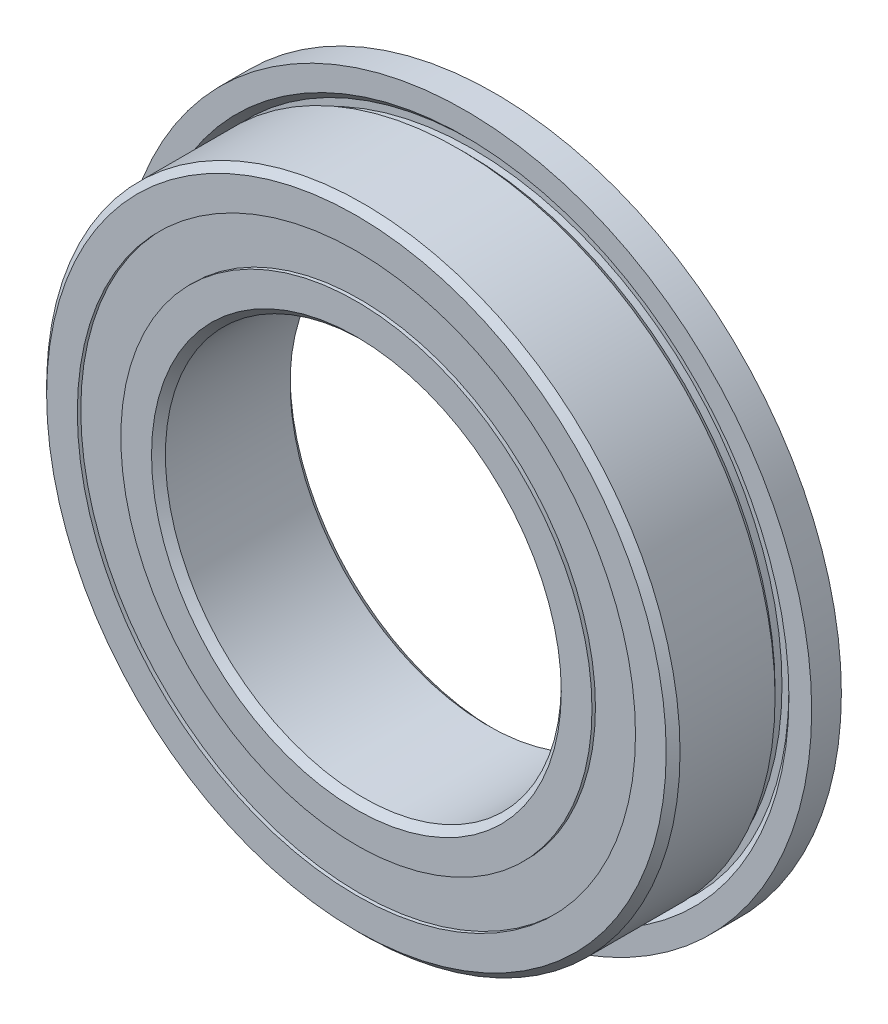
ISO-10303-21;
HEADER;
FILE_DESCRIPTION(('STEP AP214'),'2;1');
FILE_NAME('part.step','',(''),(''),'','','');
FILE_SCHEMA(('AUTOMOTIVE_DESIGN { 1 0 10303 214 1 1 1 1 }'));
ENDSEC;
DATA;
#1=APPLICATION_CONTEXT('core data for automotive mechanical design processes');
#2=APPLICATION_PROTOCOL_DEFINITION('international standard','automotive_design',2000,#1);
#3=PRODUCT_CONTEXT('',#1,'mechanical');
#4=PRODUCT('Part','Part','',(#3));
#5=PRODUCT_RELATED_PRODUCT_CATEGORY('part','',(#4));
#6=PRODUCT_DEFINITION_FORMATION('','',#4);
#7=PRODUCT_DEFINITION_CONTEXT('part definition',#1,'design');
#8=PRODUCT_DEFINITION('design','',#6,#7);
#9=PRODUCT_DEFINITION_SHAPE('','',#8);
#10=(LENGTH_UNIT() NAMED_UNIT(*) SI_UNIT(.MILLI.,.METRE.));
#11=(NAMED_UNIT(*) PLANE_ANGLE_UNIT() SI_UNIT($,.RADIAN.));
#12=(NAMED_UNIT(*) SI_UNIT($,.STERADIAN.) SOLID_ANGLE_UNIT());
#13=UNCERTAINTY_MEASURE_WITH_UNIT(LENGTH_MEASURE(1.E-05),#10,'distance_accuracy_value','');
#14=(GEOMETRIC_REPRESENTATION_CONTEXT(3) GLOBAL_UNCERTAINTY_ASSIGNED_CONTEXT((#13)) GLOBAL_UNIT_ASSIGNED_CONTEXT((#10,
#11,#12)) REPRESENTATION_CONTEXT('',''));
#15=CARTESIAN_POINT('',(0.,0.,0.));
#16=DIRECTION('',(0.,0.,1.));
#17=DIRECTION('',(1.,0.,0.));
#18=AXIS2_PLACEMENT_3D('',#15,#16,#17);
#19=CARTESIAN_POINT('',(0.,14.0989010989011,-3.325));
#20=DIRECTION('',(0.,0.,1.));
#21=DIRECTION('',(1.,0.,0.));
#22=AXIS2_PLACEMENT_3D('',#19,#20,#21);
#23=PLANE('',#22);
#24=CARTESIAN_POINT('',(0.,0.,-3.325));
#25=DIRECTION('',(0.,0.,1.));
#26=DIRECTION('',(1.,0.,0.));
#27=AXIS2_PLACEMENT_3D('',#24,#25,#26);
#28=CIRCLE('',#27,14.0989010989011);
#29=CARTESIAN_POINT('',(14.0989010989011,0.,-3.325));
#30=VERTEX_POINT('',#29);
#31=EDGE_CURVE('E62',#30,#30,#28,.T.);
#32=ORIENTED_EDGE('',*,*,#31,.F.);
#33=EDGE_LOOP('',(#32));
#34=FACE_BOUND('',#33,.T.);
#35=CARTESIAN_POINT('',(0.,0.,-3.325));
#36=DIRECTION('',(0.,0.,1.));
#37=DIRECTION('',(1.,0.,0.));
#38=AXIS2_PLACEMENT_3D('',#35,#36,#37);
#39=CIRCLE('',#38,11.9010989010989);
#40=CARTESIAN_POINT('',(11.9010989010989,0.,-3.325));
#41=VERTEX_POINT('',#40);
#42=EDGE_CURVE('E11',#41,#41,#39,.T.);
#43=ORIENTED_EDGE('',*,*,#42,.T.);
#44=EDGE_LOOP('',(#43));
#45=FACE_BOUND('',#44,.T.);
#46=ADVANCED_FACE('F48',(#34,#45),#23,.F.);
#47=CARTESIAN_POINT('',(0.,0.,3.5));
#48=DIRECTION('',(0.,0.,1.));
#49=DIRECTION('',(1.,0.,0.));
#50=AXIS2_PLACEMENT_3D('',#47,#48,#49);
#51=CYLINDRICAL_SURFACE('',#50,11.9010989010989);
#52=ORIENTED_EDGE('',*,*,#42,.F.);
#53=EDGE_LOOP('',(#52));
#54=FACE_BOUND('',#53,.T.);
#55=CARTESIAN_POINT('',(0.,0.,-1.90455682813241));
#56=DIRECTION('',(0.,0.,1.));
#57=DIRECTION('',(1.,0.,0.));
#58=AXIS2_PLACEMENT_3D('',#55,#56,#57);
#59=CIRCLE('',#58,11.9010989010989);
#60=CARTESIAN_POINT('',(11.9010989010989,0.,-1.90455682813241));
#61=VERTEX_POINT('',#60);
#62=EDGE_CURVE('E54',#61,#61,#59,.T.);
#63=ORIENTED_EDGE('',*,*,#62,.T.);
#64=EDGE_LOOP('',(#63));
#65=FACE_BOUND('',#64,.T.);
#66=ADVANCED_FACE('F71',(#54,#65),#51,.F.);
#67=CARTESIAN_POINT('',(0.,14.0989010989011,-1.90455682813241));
#68=DIRECTION('',(0.,0.,-1.));
#69=DIRECTION('',(-1.,0.,0.));
#70=AXIS2_PLACEMENT_3D('',#67,#68,#69);
#71=PLANE('',#70);
#72=ORIENTED_EDGE('',*,*,#62,.F.);
#73=EDGE_LOOP('',(#72));
#74=FACE_BOUND('',#73,.T.);
#75=CARTESIAN_POINT('',(0.,0.,-1.90455682813241));
#76=DIRECTION('',(0.,0.,1.));
#77=DIRECTION('',(1.,0.,0.));
#78=AXIS2_PLACEMENT_3D('',#75,#76,#77);
#79=CIRCLE('',#78,14.0989010989011);
#80=CARTESIAN_POINT('',(14.0989010989011,0.,-1.90455682813241));
#81=VERTEX_POINT('',#80);
#82=EDGE_CURVE('E58',#81,#81,#79,.T.);
#83=ORIENTED_EDGE('',*,*,#82,.T.);
#84=EDGE_LOOP('',(#83));
#85=FACE_BOUND('',#84,.T.);
#86=ADVANCED_FACE('F75',(#74,#85),#71,.F.);
#87=CARTESIAN_POINT('',(0.,0.,3.5));
#88=DIRECTION('',(0.,0.,1.));
#89=DIRECTION('',(1.,0.,0.));
#90=AXIS2_PLACEMENT_3D('',#87,#88,#89);
#91=CYLINDRICAL_SURFACE('',#90,14.0989010989011);
#92=ORIENTED_EDGE('',*,*,#82,.F.);
#93=EDGE_LOOP('',(#92));
#94=FACE_BOUND('',#93,.T.);
#95=ORIENTED_EDGE('',*,*,#31,.T.);
#96=EDGE_LOOP('',(#95));
#97=FACE_BOUND('',#96,.T.);
#98=ADVANCED_FACE('F68',(#94,#97),#91,.T.);
#99=CLOSED_SHELL('',(#46,#66,#86,#98));
#100=MANIFOLD_SOLID_BREP('B2',#99);
#101=CARTESIAN_POINT('',(0.,14.0989010989011,3.325));
#102=DIRECTION('',(0.,0.,-1.));
#103=DIRECTION('',(-1.,0.,0.));
#104=AXIS2_PLACEMENT_3D('',#101,#102,#103);
#105=PLANE('',#104);
#106=CARTESIAN_POINT('',(0.,0.,3.325));
#107=DIRECTION('',(0.,0.,1.));
#108=DIRECTION('',(1.,0.,0.));
#109=AXIS2_PLACEMENT_3D('',#106,#107,#108);
#110=CIRCLE('',#109,11.9010989010989);
#111=CARTESIAN_POINT('',(11.9010989010989,0.,3.325));
#112=VERTEX_POINT('',#111);
#113=EDGE_CURVE('E47',#112,#112,#110,.T.);
#114=ORIENTED_EDGE('',*,*,#113,.F.);
#115=EDGE_LOOP('',(#114));
#116=FACE_BOUND('',#115,.T.);
#117=CARTESIAN_POINT('',(0.,0.,3.325));
#118=DIRECTION('',(0.,0.,1.));
#119=DIRECTION('',(1.,0.,0.));
#120=AXIS2_PLACEMENT_3D('',#117,#118,#119);
#121=CIRCLE('',#120,14.0989010989011);
#122=CARTESIAN_POINT('',(14.0989010989011,0.,3.325));
#123=VERTEX_POINT('',#122);
#124=EDGE_CURVE('E132',#123,#123,#121,.T.);
#125=ORIENTED_EDGE('',*,*,#124,.T.);
#126=EDGE_LOOP('',(#125));
#127=FACE_BOUND('',#126,.T.);
#128=ADVANCED_FACE('F118',(#116,#127),#105,.F.);
#129=CARTESIAN_POINT('',(0.,0.,3.5));
#130=DIRECTION('',(0.,0.,1.));
#131=DIRECTION('',(1.,0.,0.));
#132=AXIS2_PLACEMENT_3D('',#129,#130,#131);
#133=CYLINDRICAL_SURFACE('',#132,11.9010989010989);
#134=CARTESIAN_POINT('',(0.,0.,1.90455682813241));
#135=DIRECTION('',(0.,0.,1.));
#136=DIRECTION('',(1.,0.,0.));
#137=AXIS2_PLACEMENT_3D('',#134,#135,#136);
#138=CIRCLE('',#137,11.9010989010989);
#139=CARTESIAN_POINT('',(11.9010989010989,0.,1.90455682813241));
#140=VERTEX_POINT('',#139);
#141=EDGE_CURVE('E124',#140,#140,#138,.T.);
#142=ORIENTED_EDGE('',*,*,#141,.F.);
#143=EDGE_LOOP('',(#142));
#144=FACE_BOUND('',#143,.T.);
#145=ORIENTED_EDGE('',*,*,#113,.T.);
#146=EDGE_LOOP('',(#145));
#147=FACE_BOUND('',#146,.T.);
#148=ADVANCED_FACE('F147',(#144,#147),#133,.F.);
#149=CARTESIAN_POINT('',(0.,14.0989010989011,1.90455682813241));
#150=DIRECTION('',(0.,0.,1.));
#151=DIRECTION('',(1.,0.,0.));
#152=AXIS2_PLACEMENT_3D('',#149,#150,#151);
#153=PLANE('',#152);
#154=CARTESIAN_POINT('',(0.,0.,1.90455682813241));
#155=DIRECTION('',(0.,0.,1.));
#156=DIRECTION('',(1.,0.,0.));
#157=AXIS2_PLACEMENT_3D('',#154,#155,#156);
#158=CIRCLE('',#157,14.0989010989011);
#159=CARTESIAN_POINT('',(14.0989010989011,0.,1.90455682813241));
#160=VERTEX_POINT('',#159);
#161=EDGE_CURVE('E128',#160,#160,#158,.T.);
#162=ORIENTED_EDGE('',*,*,#161,.F.);
#163=EDGE_LOOP('',(#162));
#164=FACE_BOUND('',#163,.T.);
#165=ORIENTED_EDGE('',*,*,#141,.T.);
#166=EDGE_LOOP('',(#165));
#167=FACE_BOUND('',#166,.T.);
#168=ADVANCED_FACE('F142',(#164,#167),#153,.F.);
#169=CARTESIAN_POINT('',(0.,0.,3.5));
#170=DIRECTION('',(0.,0.,1.));
#171=DIRECTION('',(1.,0.,0.));
#172=AXIS2_PLACEMENT_3D('',#169,#170,#171);
#173=CYLINDRICAL_SURFACE('',#172,14.0989010989011);
#174=ORIENTED_EDGE('',*,*,#124,.F.);
#175=EDGE_LOOP('',(#174));
#176=FACE_BOUND('',#175,.T.);
#177=ORIENTED_EDGE('',*,*,#161,.T.);
#178=EDGE_LOOP('',(#177));
#179=FACE_BOUND('',#178,.T.);
#180=ADVANCED_FACE('F139',(#176,#179),#173,.T.);
#181=CLOSED_SHELL('',(#128,#148,#168,#180));
#182=MANIFOLD_SOLID_BREP('B6',#181);
#183=CARTESIAN_POINT('',(-6.04140123656885,11.5109283334918,0.));
#184=DIRECTION('',(0.,0.,1.));
#185=DIRECTION('',(-0.464723172043757,0.885456025653216,0.));
#186=AXIS2_PLACEMENT_3D('',#183,#184,#185);
#187=SPHERICAL_SURFACE('',#186,1.90455682813241);
#188=CARTESIAN_POINT('',(-6.04140123656885,11.5109283334918,1.90455682813241));
#189=VERTEX_POINT('',#188);
#190=VERTEX_LOOP('',#189);
#191=FACE_BOUND('',#190,.T.);
#192=ADVANCED_FACE('F188',(#191),#187,.T.);
#193=CLOSED_SHELL('',(#192));
#194=MANIFOLD_SOLID_BREP('B42',#193);
#195=CARTESIAN_POINT('',(-10.6987902566174,7.38484170750516,0.));
#196=DIRECTION('',(0.,0.,1.));
#197=DIRECTION('',(-0.822983865893649,0.568064746731166,0.));
#198=AXIS2_PLACEMENT_3D('',#195,#196,#197);
#199=SPHERICAL_SURFACE('',#198,1.90455682813241);
#200=CARTESIAN_POINT('',(-10.6987902566174,7.38484170750516,1.90455682813241));
#201=VERTEX_POINT('',#200);
#202=VERTEX_LOOP('',#201);
#203=FACE_BOUND('',#202,.T.);
#204=ADVANCED_FACE('F211',(#203),#199,.T.);
#205=CLOSED_SHELL('',(#204));
#206=MANIFOLD_SOLID_BREP('B114',#205);
#207=CARTESIAN_POINT('',(-12.9052153632747,1.56697684331934,0.));
#208=DIRECTION('',(0.,0.,1.));
#209=DIRECTION('',(-0.992708874098053,0.120536680255334,0.));
#210=AXIS2_PLACEMENT_3D('',#207,#208,#209);
#211=SPHERICAL_SURFACE('',#210,1.90455682813241);
#212=CARTESIAN_POINT('',(-12.9052153632747,1.56697684331934,1.90455682813241));
#213=VERTEX_POINT('',#212);
#214=VERTEX_LOOP('',#213);
#215=FACE_BOUND('',#214,.T.);
#216=ADVANCED_FACE('F234',(#215),#211,.T.);
#217=CLOSED_SHELL('',(#216));
#218=MANIFOLD_SOLID_BREP('B184',#217);
#219=CARTESIAN_POINT('',(-12.1552111549104,-4.60986353155285,0.));
#220=DIRECTION('',(0.,0.,1.));
#221=DIRECTION('',(-0.935016242685418,-0.354604887042527,0.));
#222=AXIS2_PLACEMENT_3D('',#219,#220,#221);
#223=SPHERICAL_SURFACE('',#222,1.90455682813241);
#224=CARTESIAN_POINT('',(-12.1552111549104,-4.60986353155285,1.90455682813241));
#225=VERTEX_POINT('',#224);
#226=VERTEX_LOOP('',#225);
#227=FACE_BOUND('',#226,.T.);
#228=ADVANCED_FACE('F257',(#227),#223,.T.);
#229=CLOSED_SHELL('',(#228));
#230=MANIFOLD_SOLID_BREP('B207',#229);
#231=CARTESIAN_POINT('',(-8.62059455713042,-9.73063972622424,0.));
#232=DIRECTION('',(0.,0.,1.));
#233=DIRECTION('',(-0.663122658240802,-0.748510748171095,0.));
#234=AXIS2_PLACEMENT_3D('',#231,#232,#233);
#235=SPHERICAL_SURFACE('',#234,1.90455682813241);
#236=CARTESIAN_POINT('',(-8.62059455713042,-9.73063972622424,1.90455682813241));
#237=VERTEX_POINT('',#236);
#238=VERTEX_LOOP('',#237);
#239=FACE_BOUND('',#238,.T.);
#240=ADVANCED_FACE('F280',(#239),#235,.T.);
#241=CLOSED_SHELL('',(#240));
#242=MANIFOLD_SOLID_BREP('B230',#241);
#243=CARTESIAN_POINT('',(-3.11110363573835,-12.6222436265387,0.));
#244=DIRECTION('',(0.,0.,1.));
#245=DIRECTION('',(-0.239315664287565,-0.97094181742605,0.));
#246=AXIS2_PLACEMENT_3D('',#243,#244,#245);
#247=SPHERICAL_SURFACE('',#246,1.90455682813241);
#248=CARTESIAN_POINT('',(-3.11110363573835,-12.6222436265387,1.90455682813241));
#249=VERTEX_POINT('',#248);
#250=VERTEX_LOOP('',#249);
#251=FACE_BOUND('',#250,.T.);
#252=ADVANCED_FACE('F303',(#251),#247,.T.);
#253=CLOSED_SHELL('',(#252));
#254=MANIFOLD_SOLID_BREP('B253',#253);
#255=CARTESIAN_POINT('',(3.11110363573817,-12.6222436265387,0.));
#256=DIRECTION('',(0.,0.,1.));
#257=DIRECTION('',(0.239315664287552,-0.970941817426054,0.));
#258=AXIS2_PLACEMENT_3D('',#255,#256,#257);
#259=SPHERICAL_SURFACE('',#258,1.90455682813241);
#260=CARTESIAN_POINT('',(3.11110363573817,-12.6222436265387,1.90455682813241));
#261=VERTEX_POINT('',#260);
#262=VERTEX_LOOP('',#261);
#263=FACE_BOUND('',#262,.T.);
#264=ADVANCED_FACE('F326',(#263),#259,.T.);
#265=CLOSED_SHELL('',(#264));
#266=MANIFOLD_SOLID_BREP('B276',#265);
#267=CARTESIAN_POINT('',(8.62059455713029,-9.73063972622436,0.));
#268=DIRECTION('',(0.,0.,1.));
#269=DIRECTION('',(0.663122658240791,-0.748510748171105,0.));
#270=AXIS2_PLACEMENT_3D('',#267,#268,#269);
#271=SPHERICAL_SURFACE('',#270,1.90455682813241);
#272=CARTESIAN_POINT('',(8.62059455713029,-9.73063972622436,1.90455682813241));
#273=VERTEX_POINT('',#272);
#274=VERTEX_LOOP('',#273);
#275=FACE_BOUND('',#274,.T.);
#276=ADVANCED_FACE('F349',(#275),#271,.T.);
#277=CLOSED_SHELL('',(#276));
#278=MANIFOLD_SOLID_BREP('B299',#277);
#279=CARTESIAN_POINT('',(12.1552111549104,-4.60986353155302,0.));
#280=DIRECTION('',(0.,0.,1.));
#281=DIRECTION('',(0.935016242685413,-0.35460488704254,0.));
#282=AXIS2_PLACEMENT_3D('',#279,#280,#281);
#283=SPHERICAL_SURFACE('',#282,1.90455682813241);
#284=CARTESIAN_POINT('',(12.1552111549104,-4.60986353155302,1.90455682813241));
#285=VERTEX_POINT('',#284);
#286=VERTEX_LOOP('',#285);
#287=FACE_BOUND('',#286,.T.);
#288=ADVANCED_FACE('F372',(#287),#283,.T.);
#289=CLOSED_SHELL('',(#288));
#290=MANIFOLD_SOLID_BREP('B322',#289);
#291=CARTESIAN_POINT('',(12.9052153632747,1.56697684331916,0.));
#292=DIRECTION('',(0.,0.,1.));
#293=DIRECTION('',(0.992708874098054,0.12053668025532,0.));
#294=AXIS2_PLACEMENT_3D('',#291,#292,#293);
#295=SPHERICAL_SURFACE('',#294,1.90455682813241);
#296=CARTESIAN_POINT('',(12.9052153632747,1.56697684331916,1.90455682813241));
#297=VERTEX_POINT('',#296);
#298=VERTEX_LOOP('',#297);
#299=FACE_BOUND('',#298,.T.);
#300=ADVANCED_FACE('F395',(#299),#295,.T.);
#301=CLOSED_SHELL('',(#300));
#302=MANIFOLD_SOLID_BREP('B345',#301);
#303=CARTESIAN_POINT('',(10.6987902566176,7.384841707505,0.));
#304=DIRECTION('',(0.,0.,1.));
#305=DIRECTION('',(0.822983865893658,0.568064746731154,0.));
#306=AXIS2_PLACEMENT_3D('',#303,#304,#305);
#307=SPHERICAL_SURFACE('',#306,1.90455682813241);
#308=CARTESIAN_POINT('',(10.6987902566176,7.384841707505,1.90455682813241));
#309=VERTEX_POINT('',#308);
#310=VERTEX_LOOP('',#309);
#311=FACE_BOUND('',#310,.T.);
#312=ADVANCED_FACE('F418',(#311),#307,.T.);
#313=CLOSED_SHELL('',(#312));
#314=MANIFOLD_SOLID_BREP('B368',#313);
#315=CARTESIAN_POINT('',(6.04140123656901,11.5109283334917,0.));
#316=DIRECTION('',(0.,0.,1.));
#317=DIRECTION('',(0.46472317204377,0.885456025653209,0.));
#318=AXIS2_PLACEMENT_3D('',#315,#316,#317);
#319=SPHERICAL_SURFACE('',#318,1.90455682813241);
#320=CARTESIAN_POINT('',(6.04140123656901,11.5109283334917,1.90455682813241));
#321=VERTEX_POINT('',#320);
#322=VERTEX_LOOP('',#321);
#323=FACE_BOUND('',#322,.T.);
#324=ADVANCED_FACE('F441',(#323),#319,.T.);
#325=CLOSED_SHELL('',(#324));
#326=MANIFOLD_SOLID_BREP('B391',#325);
#327=CARTESIAN_POINT('',(0.,13.,0.));
#328=DIRECTION('',(0.,0.,1.));
#329=DIRECTION('',(0.,1.,0.));
#330=AXIS2_PLACEMENT_3D('',#327,#328,#329);
#331=SPHERICAL_SURFACE('',#330,1.90455682813241);
#332=CARTESIAN_POINT('',(0.,13.,1.90455682813241));
#333=VERTEX_POINT('',#332);
#334=VERTEX_LOOP('',#333);
#335=FACE_BOUND('',#334,.T.);
#336=ADVANCED_FACE('F466',(#335),#331,.T.);
#337=CLOSED_SHELL('',(#336));
#338=MANIFOLD_SOLID_BREP('B414',#337);
#339=CARTESIAN_POINT('',(0.,13.5494505494506,0.183150183150183));
#340=DIRECTION('',(0.,0.,-1.));
#341=DIRECTION('',(-1.,0.,0.));
#342=AXIS2_PLACEMENT_3D('',#339,#340,#341);
#343=PLANE('',#342);
#344=CARTESIAN_POINT('',(0.,0.,0.183150183150183));
#345=DIRECTION('',(0.,0.,1.));
#346=DIRECTION('',(1.,0.,0.));
#347=AXIS2_PLACEMENT_3D('',#344,#345,#346);
#348=CIRCLE('',#347,12.4505494505495);
#349=CARTESIAN_POINT('',(12.4505494505495,0.,0.183150183150183));
#350=VERTEX_POINT('',#349);
#351=EDGE_CURVE('E465',#350,#350,#348,.T.);
#352=ORIENTED_EDGE('',*,*,#351,.F.);
#353=EDGE_LOOP('',(#352));
#354=FACE_BOUND('',#353,.T.);
#355=CARTESIAN_POINT('',(0.,0.,0.183150183150183));
#356=DIRECTION('',(0.,0.,1.));
#357=DIRECTION('',(1.,0.,0.));
#358=AXIS2_PLACEMENT_3D('',#355,#356,#357);
#359=CIRCLE('',#358,13.5494505494506);
#360=CARTESIAN_POINT('',(13.5494505494506,0.,0.183150183150183));
#361=VERTEX_POINT('',#360);
#362=EDGE_CURVE('E503',#361,#361,#359,.T.);
#363=ORIENTED_EDGE('',*,*,#362,.T.);
#364=EDGE_LOOP('',(#363));
#365=FACE_BOUND('',#364,.T.);
#366=ADVANCED_FACE('F489',(#354,#365),#343,.F.);
#367=CARTESIAN_POINT('',(0.,0.,3.5));
#368=DIRECTION('',(0.,0.,1.));
#369=DIRECTION('',(1.,0.,0.));
#370=AXIS2_PLACEMENT_3D('',#367,#368,#369);
#371=CYLINDRICAL_SURFACE('',#370,12.4505494505495);
#372=CARTESIAN_POINT('',(0.,0.,-0.183150183150183));
#373=DIRECTION('',(0.,0.,1.));
#374=DIRECTION('',(1.,0.,0.));
#375=AXIS2_PLACEMENT_3D('',#372,#373,#374);
#376=CIRCLE('',#375,12.4505494505495);
#377=CARTESIAN_POINT('',(12.4505494505495,0.,-0.183150183150183));
#378=VERTEX_POINT('',#377);
#379=EDGE_CURVE('E495',#378,#378,#376,.T.);
#380=ORIENTED_EDGE('',*,*,#379,.F.);
#381=EDGE_LOOP('',(#380));
#382=FACE_BOUND('',#381,.T.);
#383=ORIENTED_EDGE('',*,*,#351,.T.);
#384=EDGE_LOOP('',(#383));
#385=FACE_BOUND('',#384,.T.);
#386=ADVANCED_FACE('F518',(#382,#385),#371,.F.);
#387=CARTESIAN_POINT('',(0.,13.5494505494506,-0.183150183150183));
#388=DIRECTION('',(0.,0.,1.));
#389=DIRECTION('',(1.,0.,0.));
#390=AXIS2_PLACEMENT_3D('',#387,#388,#389);
#391=PLANE('',#390);
#392=CARTESIAN_POINT('',(0.,0.,-0.183150183150183));
#393=DIRECTION('',(0.,0.,1.));
#394=DIRECTION('',(1.,0.,0.));
#395=AXIS2_PLACEMENT_3D('',#392,#393,#394);
#396=CIRCLE('',#395,13.5494505494506);
#397=CARTESIAN_POINT('',(13.5494505494506,0.,-0.183150183150183));
#398=VERTEX_POINT('',#397);
#399=EDGE_CURVE('E499',#398,#398,#396,.T.);
#400=ORIENTED_EDGE('',*,*,#399,.F.);
#401=EDGE_LOOP('',(#400));
#402=FACE_BOUND('',#401,.T.);
#403=ORIENTED_EDGE('',*,*,#379,.T.);
#404=EDGE_LOOP('',(#403));
#405=FACE_BOUND('',#404,.T.);
#406=ADVANCED_FACE('F513',(#402,#405),#391,.F.);
#407=CARTESIAN_POINT('',(0.,0.,3.5));
#408=DIRECTION('',(0.,0.,1.));
#409=DIRECTION('',(1.,0.,0.));
#410=AXIS2_PLACEMENT_3D('',#407,#408,#409);
#411=CYLINDRICAL_SURFACE('',#410,13.5494505494506);
#412=ORIENTED_EDGE('',*,*,#362,.F.);
#413=EDGE_LOOP('',(#412));
#414=FACE_BOUND('',#413,.T.);
#415=ORIENTED_EDGE('',*,*,#399,.T.);
#416=EDGE_LOOP('',(#415));
#417=FACE_BOUND('',#416,.T.);
#418=ADVANCED_FACE('F510',(#414,#417),#411,.T.);
#419=CLOSED_SHELL('',(#366,#386,#406,#418));
#420=MANIFOLD_SOLID_BREP('B437',#419);
#421=CARTESIAN_POINT('',(0.,11.9010989010989,3.5));
#422=DIRECTION('',(0.,0.,-1.));
#423=DIRECTION('',(-1.,0.,0.));
#424=AXIS2_PLACEMENT_3D('',#421,#422,#423);
#425=PLANE('',#424);
#426=CARTESIAN_POINT('',(0.,0.,3.5));
#427=DIRECTION('',(0.,0.,1.));
#428=DIRECTION('',(1.,0.,0.));
#429=AXIS2_PLACEMENT_3D('',#426,#427,#428);
#430=CIRCLE('',#429,10.35);
#431=CARTESIAN_POINT('',(10.35,0.,3.5));
#432=VERTEX_POINT('',#431);
#433=EDGE_CURVE('E588',#432,#432,#430,.T.);
#434=ORIENTED_EDGE('',*,*,#433,.F.);
#435=EDGE_LOOP('',(#434));
#436=FACE_BOUND('',#435,.T.);
#437=CARTESIAN_POINT('',(0.,0.,3.5));
#438=DIRECTION('',(0.,0.,1.));
#439=DIRECTION('',(1.,0.,0.));
#440=AXIS2_PLACEMENT_3D('',#437,#438,#439);
#441=CIRCLE('',#440,11.9010989010989);
#442=CARTESIAN_POINT('',(11.9010989010989,0.,3.5));
#443=VERTEX_POINT('',#442);
#444=EDGE_CURVE('E488',#443,#443,#441,.T.);
#445=ORIENTED_EDGE('',*,*,#444,.T.);
#446=EDGE_LOOP('',(#445));
#447=FACE_BOUND('',#446,.T.);
#448=ADVANCED_FACE('F560',(#436,#447),#425,.F.);
#449=CARTESIAN_POINT('',(0.,0.,3.5));
#450=DIRECTION('',(0.,0.,1.));
#451=DIRECTION('',(1.,0.,0.));
#452=AXIS2_PLACEMENT_3D('',#449,#450,#451);
#453=CYLINDRICAL_SURFACE('',#452,11.9010989010989);
#454=ORIENTED_EDGE('',*,*,#444,.F.);
#455=EDGE_LOOP('',(#454));
#456=FACE_BOUND('',#455,.T.);
#457=CARTESIAN_POINT('',(0.,0.,1.55555555555556));
#458=DIRECTION('',(0.,0.,1.));
#459=DIRECTION('',(1.,0.,0.));
#460=AXIS2_PLACEMENT_3D('',#457,#458,#459);
#461=CIRCLE('',#460,11.9010989010989);
#462=CARTESIAN_POINT('',(11.9010989010989,0.,1.55555555555556));
#463=VERTEX_POINT('',#462);
#464=EDGE_CURVE('E566',#463,#463,#461,.T.);
#465=ORIENTED_EDGE('',*,*,#464,.T.);
#466=EDGE_LOOP('',(#465));
#467=FACE_BOUND('',#466,.T.);
#468=ADVANCED_FACE('F595',(#456,#467),#453,.T.);
#469=CARTESIAN_POINT('',(0.,0.,0.));
#470=DIRECTION('',(0.,0.,1.));
#471=DIRECTION('',(1.,0.,0.));
#472=AXIS2_PLACEMENT_3D('',#469,#470,#471);
#473=TOROIDAL_SURFACE('',#472,13.,1.90455682813241);
#474=ORIENTED_EDGE('',*,*,#464,.F.);
#475=EDGE_LOOP('',(#474));
#476=FACE_BOUND('',#475,.T.);
#477=CARTESIAN_POINT('',(0.,0.,-1.55555555555556));
#478=DIRECTION('',(0.,0.,1.));
#479=DIRECTION('',(1.,0.,0.));
#480=AXIS2_PLACEMENT_3D('',#477,#478,#479);
#481=CIRCLE('',#480,11.9010989010989);
#482=CARTESIAN_POINT('',(11.9010989010989,0.,-1.55555555555556));
#483=VERTEX_POINT('',#482);
#484=EDGE_CURVE('E570',#483,#483,#481,.T.);
#485=ORIENTED_EDGE('',*,*,#484,.T.);
#486=EDGE_LOOP('',(#485));
#487=FACE_BOUND('',#486,.T.);
#488=ADVANCED_FACE('F599',(#476,#487),#473,.F.);
#489=CARTESIAN_POINT('',(0.,0.,3.5));
#490=DIRECTION('',(0.,0.,1.));
#491=DIRECTION('',(1.,0.,0.));
#492=AXIS2_PLACEMENT_3D('',#489,#490,#491);
#493=CYLINDRICAL_SURFACE('',#492,11.9010989010989);
#494=ORIENTED_EDGE('',*,*,#484,.F.);
#495=EDGE_LOOP('',(#494));
#496=FACE_BOUND('',#495,.T.);
#497=CARTESIAN_POINT('',(0.,0.,-3.5));
#498=DIRECTION('',(0.,0.,1.));
#499=DIRECTION('',(1.,0.,0.));
#500=AXIS2_PLACEMENT_3D('',#497,#498,#499);
#501=CIRCLE('',#500,11.9010989010989);
#502=CARTESIAN_POINT('',(11.9010989010989,0.,-3.5));
#503=VERTEX_POINT('',#502);
#504=EDGE_CURVE('E574',#503,#503,#501,.T.);
#505=ORIENTED_EDGE('',*,*,#504,.T.);
#506=EDGE_LOOP('',(#505));
#507=FACE_BOUND('',#506,.T.);
#508=ADVANCED_FACE('F604',(#496,#507),#493,.T.);
#509=CARTESIAN_POINT('',(0.,10.35,-3.5));
#510=DIRECTION('',(0.,0.,1.));
#511=DIRECTION('',(1.,0.,0.));
#512=AXIS2_PLACEMENT_3D('',#509,#510,#511);
#513=PLANE('',#512);
#514=ORIENTED_EDGE('',*,*,#504,.F.);
#515=EDGE_LOOP('',(#514));
#516=FACE_BOUND('',#515,.T.);
#517=CARTESIAN_POINT('',(0.,0.,-3.5));
#518=DIRECTION('',(0.,0.,1.));
#519=DIRECTION('',(1.,0.,0.));
#520=AXIS2_PLACEMENT_3D('',#517,#518,#519);
#521=CIRCLE('',#520,10.35);
#522=CARTESIAN_POINT('',(10.35,0.,-3.5));
#523=VERTEX_POINT('',#522);
#524=EDGE_CURVE('E579',#523,#523,#521,.T.);
#525=ORIENTED_EDGE('',*,*,#524,.T.);
#526=EDGE_LOOP('',(#525));
#527=FACE_BOUND('',#526,.T.);
#528=ADVANCED_FACE('F610',(#516,#527),#513,.F.);
#529=CARTESIAN_POINT('',(0.,0.,-3.15));
#530=DIRECTION('',(0.,0.,-1.));
#531=DIRECTION('',(-1.,0.,0.));
#532=AXIS2_PLACEMENT_3D('',#529,#530,#531);
#533=CONICAL_SURFACE('',#532,10.,0.785398163397448);
#534=ORIENTED_EDGE('',*,*,#524,.F.);
#535=EDGE_LOOP('',(#534));
#536=FACE_BOUND('',#535,.T.);
#537=CARTESIAN_POINT('',(0.,0.,-3.15));
#538=DIRECTION('',(0.,0.,1.));
#539=DIRECTION('',(1.,0.,0.));
#540=AXIS2_PLACEMENT_3D('',#537,#538,#539);
#541=CIRCLE('',#540,10.);
#542=CARTESIAN_POINT('',(10.,0.,-3.15));
#543=VERTEX_POINT('',#542);
#544=EDGE_CURVE('E582',#543,#543,#541,.T.);
#545=ORIENTED_EDGE('',*,*,#544,.T.);
#546=EDGE_LOOP('',(#545));
#547=FACE_BOUND('',#546,.T.);
#548=ADVANCED_FACE('F614',(#536,#547),#533,.F.);
#549=CARTESIAN_POINT('',(0.,0.,3.5));
#550=DIRECTION('',(0.,0.,1.));
#551=DIRECTION('',(1.,0.,0.));
#552=AXIS2_PLACEMENT_3D('',#549,#550,#551);
#553=CYLINDRICAL_SURFACE('',#552,10.);
#554=ORIENTED_EDGE('',*,*,#544,.F.);
#555=EDGE_LOOP('',(#554));
#556=FACE_BOUND('',#555,.T.);
#557=CARTESIAN_POINT('',(0.,0.,3.15));
#558=DIRECTION('',(0.,0.,1.));
#559=DIRECTION('',(1.,0.,0.));
#560=AXIS2_PLACEMENT_3D('',#557,#558,#559);
#561=CIRCLE('',#560,10.);
#562=CARTESIAN_POINT('',(10.,0.,3.15));
#563=VERTEX_POINT('',#562);
#564=EDGE_CURVE('E585',#563,#563,#561,.T.);
#565=ORIENTED_EDGE('',*,*,#564,.T.);
#566=EDGE_LOOP('',(#565));
#567=FACE_BOUND('',#566,.T.);
#568=ADVANCED_FACE('F618',(#556,#567),#553,.F.);
#569=CARTESIAN_POINT('',(0.,0.,3.5));
#570=DIRECTION('',(0.,0.,1.));
#571=DIRECTION('',(1.,0.,0.));
#572=AXIS2_PLACEMENT_3D('',#569,#570,#571);
#573=CONICAL_SURFACE('',#572,10.35,0.785398163397455);
#574=ORIENTED_EDGE('',*,*,#564,.F.);
#575=EDGE_LOOP('',(#574));
#576=FACE_BOUND('',#575,.T.);
#577=ORIENTED_EDGE('',*,*,#433,.T.);
#578=EDGE_LOOP('',(#577));
#579=FACE_BOUND('',#578,.T.);
#580=ADVANCED_FACE('F592',(#576,#579),#573,.F.);
#581=CLOSED_SHELL('',(#448,#468,#488,#508,#528,#548,#568,#580));
#582=MANIFOLD_SOLID_BREP('B460',#581);
#583=CARTESIAN_POINT('',(0.,0.,3.5));
#584=DIRECTION('',(0.,0.,1.));
#585=DIRECTION('',(1.,0.,0.));
#586=AXIS2_PLACEMENT_3D('',#583,#584,#585);
#587=CYLINDRICAL_SURFACE('',#586,17.5);
#588=CARTESIAN_POINT('',(0.,0.,-1.99999999999991));
#589=DIRECTION('',(0.,0.,1.));
#590=DIRECTION('',(1.,0.,0.));
#591=AXIS2_PLACEMENT_3D('',#588,#589,#590);
#592=CIRCLE('',#591,17.5);
#593=CARTESIAN_POINT('',(17.5,0.,-1.99999999999991));
#594=VERTEX_POINT('',#593);
#595=EDGE_CURVE('E690',#594,#594,#592,.T.);
#596=ORIENTED_EDGE('',*,*,#595,.F.);
#597=EDGE_LOOP('',(#596));
#598=FACE_BOUND('',#597,.T.);
#599=CARTESIAN_POINT('',(0.,0.,-3.49999999999999));
#600=DIRECTION('',(0.,0.,1.));
#601=DIRECTION('',(1.,0.,0.));
#602=AXIS2_PLACEMENT_3D('',#599,#600,#601);
#603=CIRCLE('',#602,17.5);
#604=CARTESIAN_POINT('',(17.5,0.,-3.49999999999999));
#605=VERTEX_POINT('',#604);
#606=EDGE_CURVE('E559',#605,#605,#603,.T.);
#607=ORIENTED_EDGE('',*,*,#606,.T.);
#608=EDGE_LOOP('',(#607));
#609=FACE_BOUND('',#608,.T.);
#610=ADVANCED_FACE('F684',(#598,#609),#587,.T.);
#611=CARTESIAN_POINT('',(0.,17.5,-1.99999999999991));
#612=DIRECTION('',(0.,0.,-1.));
#613=DIRECTION('',(-1.,0.,0.));
#614=AXIS2_PLACEMENT_3D('',#611,#612,#613);
#615=PLANE('',#614);
#616=CARTESIAN_POINT('',(0.,0.,-1.99999999999991));
#617=DIRECTION('',(0.,0.,1.));
#618=DIRECTION('',(1.,0.,0.));
#619=AXIS2_PLACEMENT_3D('',#616,#617,#618);
#620=CIRCLE('',#619,16.35);
#621=CARTESIAN_POINT('',(16.35,0.,-1.99999999999991));
#622=VERTEX_POINT('',#621);
#623=EDGE_CURVE('E694',#622,#622,#620,.T.);
#624=ORIENTED_EDGE('',*,*,#623,.F.);
#625=EDGE_LOOP('',(#624));
#626=FACE_BOUND('',#625,.T.);
#627=ORIENTED_EDGE('',*,*,#595,.T.);
#628=EDGE_LOOP('',(#627));
#629=FACE_BOUND('',#628,.T.);
#630=ADVANCED_FACE('F790',(#626,#629),#615,.F.);
#631=CARTESIAN_POINT('',(0.,0.,-1.99999999999991));
#632=DIRECTION('',(0.,0.,1.));
#633=DIRECTION('',(1.,0.,0.));
#634=AXIS2_PLACEMENT_3D('',#631,#632,#633);
#635=CONICAL_SURFACE('',#634,16.35,0.785398163397451);
#636=CARTESIAN_POINT('',(0.,0.,-2.34999999999991));
#637=DIRECTION('',(0.,0.,1.));
#638=DIRECTION('',(1.,0.,0.));
#639=AXIS2_PLACEMENT_3D('',#636,#637,#638);
#640=CIRCLE('',#639,16.);
#641=CARTESIAN_POINT('',(16.,0.,-2.34999999999991));
#642=VERTEX_POINT('',#641);
#643=EDGE_CURVE('E698',#642,#642,#640,.T.);
#644=ORIENTED_EDGE('',*,*,#643,.F.);
#645=EDGE_LOOP('',(#644));
#646=FACE_BOUND('',#645,.T.);
#647=ORIENTED_EDGE('',*,*,#623,.T.);
#648=EDGE_LOOP('',(#647));
#649=FACE_BOUND('',#648,.T.);
#650=ADVANCED_FACE('F784',(#646,#649),#635,.F.);
#651=CARTESIAN_POINT('',(0.,16.,-2.34999999999991));
#652=DIRECTION('',(0.,0.,-1.));
#653=DIRECTION('',(-1.,0.,0.));
#654=AXIS2_PLACEMENT_3D('',#651,#652,#653);
#655=PLANE('',#654);
#656=CARTESIAN_POINT('',(0.,0.,-2.34999999999991));
#657=DIRECTION('',(0.,0.,1.));
#658=DIRECTION('',(1.,0.,0.));
#659=AXIS2_PLACEMENT_3D('',#656,#657,#658);
#660=CIRCLE('',#659,15.65);
#661=CARTESIAN_POINT('',(15.65,0.,-2.34999999999991));
#662=VERTEX_POINT('',#661);
#663=EDGE_CURVE('E703',#662,#662,#660,.T.);
#664=ORIENTED_EDGE('',*,*,#663,.F.);
#665=EDGE_LOOP('',(#664));
#666=FACE_BOUND('',#665,.T.);
#667=ORIENTED_EDGE('',*,*,#643,.T.);
#668=EDGE_LOOP('',(#667));
#669=FACE_BOUND('',#668,.T.);
#670=ADVANCED_FACE('F778',(#666,#669),#655,.F.);
#671=CARTESIAN_POINT('',(0.,0.,3.5));
#672=DIRECTION('',(0.,0.,1.));
#673=DIRECTION('',(1.,0.,0.));
#674=AXIS2_PLACEMENT_3D('',#671,#672,#673);
#675=CYLINDRICAL_SURFACE('',#674,15.65);
#676=CARTESIAN_POINT('',(0.,0.,-1.99999999999991));
#677=DIRECTION('',(0.,0.,1.));
#678=DIRECTION('',(1.,0.,0.));
#679=AXIS2_PLACEMENT_3D('',#676,#677,#678);
#680=CIRCLE('',#679,15.65);
#681=CARTESIAN_POINT('',(15.65,0.,-1.99999999999991));
#682=VERTEX_POINT('',#681);
#683=EDGE_CURVE('E706',#682,#682,#680,.T.);
#684=ORIENTED_EDGE('',*,*,#683,.F.);
#685=EDGE_LOOP('',(#684));
#686=FACE_BOUND('',#685,.T.);
#687=ORIENTED_EDGE('',*,*,#663,.T.);
#688=EDGE_LOOP('',(#687));
#689=FACE_BOUND('',#688,.T.);
#690=ADVANCED_FACE('F772',(#686,#689),#675,.T.);
#691=CARTESIAN_POINT('',(0.,0.,-1.99999999999991));
#692=DIRECTION('',(0.,0.,1.));
#693=DIRECTION('',(1.,0.,0.));
#694=AXIS2_PLACEMENT_3D('',#691,#692,#693);
#695=CONICAL_SURFACE('',#694,15.65,0.785398163397456);
#696=CARTESIAN_POINT('',(0.,0.,-1.6499999999999));
#697=DIRECTION('',(0.,0.,1.));
#698=DIRECTION('',(1.,0.,0.));
#699=AXIS2_PLACEMENT_3D('',#696,#697,#698);
#700=CIRCLE('',#699,16.);
#701=CARTESIAN_POINT('',(16.,0.,-1.6499999999999));
#702=VERTEX_POINT('',#701);
#703=EDGE_CURVE('E709',#702,#702,#700,.T.);
#704=ORIENTED_EDGE('',*,*,#703,.F.);
#705=EDGE_LOOP('',(#704));
#706=FACE_BOUND('',#705,.T.);
#707=ORIENTED_EDGE('',*,*,#683,.T.);
#708=EDGE_LOOP('',(#707));
#709=FACE_BOUND('',#708,.T.);
#710=ADVANCED_FACE('F766',(#706,#709),#695,.T.);
#711=CARTESIAN_POINT('',(0.,0.,3.5));
#712=DIRECTION('',(0.,0.,1.));
#713=DIRECTION('',(1.,0.,0.));
#714=AXIS2_PLACEMENT_3D('',#711,#712,#713);
#715=CYLINDRICAL_SURFACE('',#714,16.);
#716=CARTESIAN_POINT('',(0.,0.,3.15));
#717=DIRECTION('',(0.,0.,1.));
#718=DIRECTION('',(1.,0.,0.));
#719=AXIS2_PLACEMENT_3D('',#716,#717,#718);
#720=CIRCLE('',#719,16.);
#721=CARTESIAN_POINT('',(16.,0.,3.15));
#722=VERTEX_POINT('',#721);
#723=EDGE_CURVE('E712',#722,#722,#720,.T.);
#724=ORIENTED_EDGE('',*,*,#723,.F.);
#725=EDGE_LOOP('',(#724));
#726=FACE_BOUND('',#725,.T.);
#727=ORIENTED_EDGE('',*,*,#703,.T.);
#728=EDGE_LOOP('',(#727));
#729=FACE_BOUND('',#728,.T.);
#730=ADVANCED_FACE('F760',(#726,#729),#715,.T.);
#731=CARTESIAN_POINT('',(0.,0.,3.15));
#732=DIRECTION('',(0.,0.,-1.));
#733=DIRECTION('',(-1.,0.,0.));
#734=AXIS2_PLACEMENT_3D('',#731,#732,#733);
#735=CONICAL_SURFACE('',#734,16.,0.785398163397446);
#736=CARTESIAN_POINT('',(0.,0.,3.5));
#737=DIRECTION('',(0.,0.,1.));
#738=DIRECTION('',(1.,0.,0.));
#739=AXIS2_PLACEMENT_3D('',#736,#737,#738);
#740=CIRCLE('',#739,15.65);
#741=CARTESIAN_POINT('',(15.65,0.,3.5));
#742=VERTEX_POINT('',#741);
#743=EDGE_CURVE('E715',#742,#742,#740,.T.);
#744=ORIENTED_EDGE('',*,*,#743,.F.);
#745=EDGE_LOOP('',(#744));
#746=FACE_BOUND('',#745,.T.);
#747=ORIENTED_EDGE('',*,*,#723,.T.);
#748=EDGE_LOOP('',(#747));
#749=FACE_BOUND('',#748,.T.);
#750=ADVANCED_FACE('F754',(#746,#749),#735,.T.);
#751=CARTESIAN_POINT('',(0.,15.65,3.5));
#752=DIRECTION('',(0.,0.,-1.));
#753=DIRECTION('',(-1.,0.,0.));
#754=AXIS2_PLACEMENT_3D('',#751,#752,#753);
#755=PLANE('',#754);
#756=CARTESIAN_POINT('',(0.,0.,3.5));
#757=DIRECTION('',(0.,0.,1.));
#758=DIRECTION('',(1.,0.,0.));
#759=AXIS2_PLACEMENT_3D('',#756,#757,#758);
#760=CIRCLE('',#759,14.0989010989011);
#761=CARTESIAN_POINT('',(14.0989010989011,0.,3.5));
#762=VERTEX_POINT('',#761);
#763=EDGE_CURVE('E718',#762,#762,#760,.T.);
#764=ORIENTED_EDGE('',*,*,#763,.F.);
#765=EDGE_LOOP('',(#764));
#766=FACE_BOUND('',#765,.T.);
#767=ORIENTED_EDGE('',*,*,#743,.T.);
#768=EDGE_LOOP('',(#767));
#769=FACE_BOUND('',#768,.T.);
#770=ADVANCED_FACE('F748',(#766,#769),#755,.F.);
#771=CARTESIAN_POINT('',(0.,0.,3.5));
#772=DIRECTION('',(0.,0.,1.));
#773=DIRECTION('',(1.,0.,0.));
#774=AXIS2_PLACEMENT_3D('',#771,#772,#773);
#775=CYLINDRICAL_SURFACE('',#774,14.0989010989011);
#776=CARTESIAN_POINT('',(0.,0.,1.55555555555556));
#777=DIRECTION('',(0.,0.,1.));
#778=DIRECTION('',(1.,0.,0.));
#779=AXIS2_PLACEMENT_3D('',#776,#777,#778);
#780=CIRCLE('',#779,14.0989010989011);
#781=CARTESIAN_POINT('',(14.0989010989011,0.,1.55555555555556));
#782=VERTEX_POINT('',#781);
#783=EDGE_CURVE('E721',#782,#782,#780,.T.);
#784=ORIENTED_EDGE('',*,*,#783,.F.);
#785=EDGE_LOOP('',(#784));
#786=FACE_BOUND('',#785,.T.);
#787=ORIENTED_EDGE('',*,*,#763,.T.);
#788=EDGE_LOOP('',(#787));
#789=FACE_BOUND('',#788,.T.);
#790=ADVANCED_FACE('F742',(#786,#789),#775,.F.);
#791=CARTESIAN_POINT('',(0.,0.,0.));
#792=DIRECTION('',(0.,0.,1.));
#793=DIRECTION('',(1.,0.,0.));
#794=AXIS2_PLACEMENT_3D('',#791,#792,#793);
#795=TOROIDAL_SURFACE('',#794,13.,1.90455682813241);
#796=CARTESIAN_POINT('',(0.,0.,-1.55555555555556));
#797=DIRECTION('',(0.,0.,1.));
#798=DIRECTION('',(1.,0.,0.));
#799=AXIS2_PLACEMENT_3D('',#796,#797,#798);
#800=CIRCLE('',#799,14.0989010989011);
#801=CARTESIAN_POINT('',(14.0989010989011,0.,-1.55555555555556));
#802=VERTEX_POINT('',#801);
#803=EDGE_CURVE('E724',#802,#802,#800,.T.);
#804=ORIENTED_EDGE('',*,*,#803,.F.);
#805=EDGE_LOOP('',(#804));
#806=FACE_BOUND('',#805,.T.);
#807=ORIENTED_EDGE('',*,*,#783,.T.);
#808=EDGE_LOOP('',(#807));
#809=FACE_BOUND('',#808,.T.);
#810=ADVANCED_FACE('F736',(#806,#809),#795,.F.);
#811=CARTESIAN_POINT('',(0.,0.,3.5));
#812=DIRECTION('',(0.,0.,1.));
#813=DIRECTION('',(1.,0.,0.));
#814=AXIS2_PLACEMENT_3D('',#811,#812,#813);
#815=CYLINDRICAL_SURFACE('',#814,14.0989010989011);
#816=CARTESIAN_POINT('',(0.,0.,-3.5));
#817=DIRECTION('',(0.,0.,1.));
#818=DIRECTION('',(1.,0.,0.));
#819=AXIS2_PLACEMENT_3D('',#816,#817,#818);
#820=CIRCLE('',#819,14.0989010989011);
#821=CARTESIAN_POINT('',(14.0989010989011,0.,-3.5));
#822=VERTEX_POINT('',#821);
#823=EDGE_CURVE('E727',#822,#822,#820,.T.);
#824=ORIENTED_EDGE('',*,*,#823,.F.);
#825=EDGE_LOOP('',(#824));
#826=FACE_BOUND('',#825,.T.);
#827=ORIENTED_EDGE('',*,*,#803,.T.);
#828=EDGE_LOOP('',(#827));
#829=FACE_BOUND('',#828,.T.);
#830=ADVANCED_FACE('F733',(#826,#829),#815,.F.);
#831=CARTESIAN_POINT('',(0.,14.0989010989011,-3.5));
#832=DIRECTION('',(0.,0.,1.));
#833=DIRECTION('',(1.,0.,0.));
#834=AXIS2_PLACEMENT_3D('',#831,#832,#833);
#835=PLANE('',#834);
#836=ORIENTED_EDGE('',*,*,#606,.F.);
#837=EDGE_LOOP('',(#836));
#838=FACE_BOUND('',#837,.T.);
#839=ORIENTED_EDGE('',*,*,#823,.T.);
#840=EDGE_LOOP('',(#839));
#841=FACE_BOUND('',#840,.T.);
#842=ADVANCED_FACE('F731',(#838,#841),#835,.F.);
#843=CLOSED_SHELL('',(#610,#630,#650,#670,#690,#710,#730,#750,#770,#790,#810,#830,#842));
#844=MANIFOLD_SOLID_BREP('B483',#843);
#845=ADVANCED_BREP_SHAPE_REPRESENTATION('',(#18,#100,#182,#194,#206,#218,#230,#242,#254,#266,
#278,#290,#302,#314,#326,#338,#420,#582,#844),#14);
#846=SHAPE_DEFINITION_REPRESENTATION(#9,#845);
ENDSEC;
END-ISO-10303-21;
